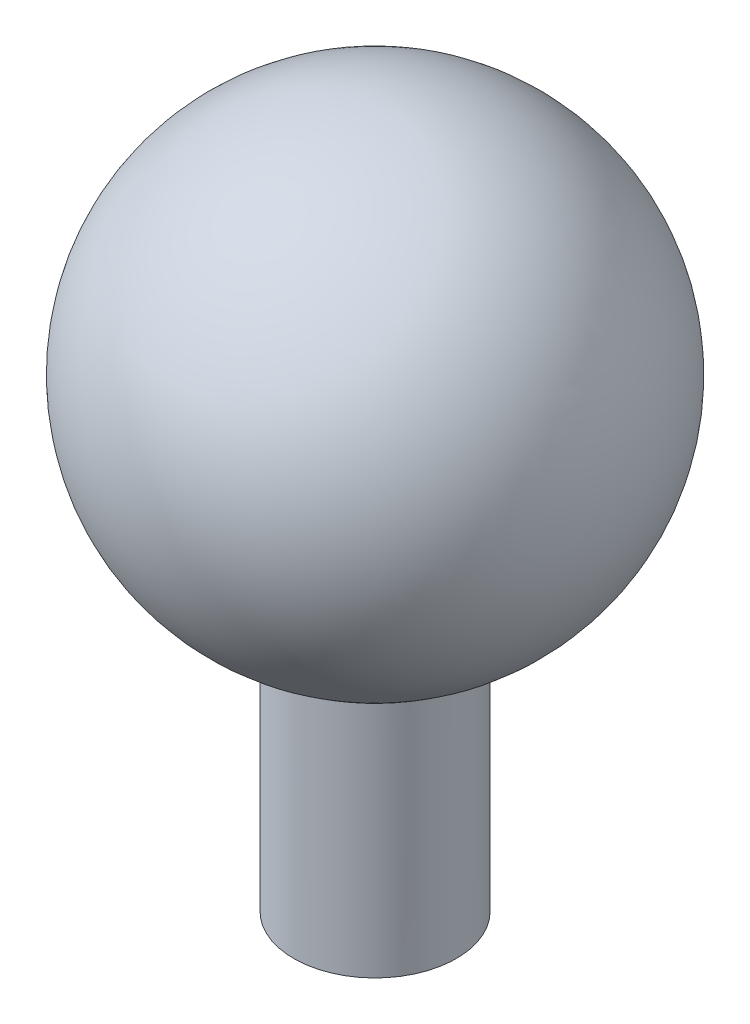
ISO-10303-21;
HEADER;
FILE_DESCRIPTION(('STEP AP214'),'2;1');
FILE_NAME('part.step','',(''),(''),'','','');
FILE_SCHEMA(('AUTOMOTIVE_DESIGN { 1 0 10303 214 1 1 1 1 }'));
ENDSEC;
DATA;
#1=APPLICATION_CONTEXT('core data for automotive mechanical design processes');
#2=APPLICATION_PROTOCOL_DEFINITION('international standard','automotive_design',2000,#1);
#3=PRODUCT_CONTEXT('',#1,'mechanical');
#4=PRODUCT('Part','Part','',(#3));
#5=PRODUCT_RELATED_PRODUCT_CATEGORY('part','',(#4));
#6=PRODUCT_DEFINITION_FORMATION('','',#4);
#7=PRODUCT_DEFINITION_CONTEXT('part definition',#1,'design');
#8=PRODUCT_DEFINITION('design','',#6,#7);
#9=PRODUCT_DEFINITION_SHAPE('','',#8);
#10=(LENGTH_UNIT() NAMED_UNIT(*) SI_UNIT(.MILLI.,.METRE.));
#11=(NAMED_UNIT(*) PLANE_ANGLE_UNIT() SI_UNIT($,.RADIAN.));
#12=(NAMED_UNIT(*) SI_UNIT($,.STERADIAN.) SOLID_ANGLE_UNIT());
#13=UNCERTAINTY_MEASURE_WITH_UNIT(LENGTH_MEASURE(1.E-05),#10,'distance_accuracy_value','');
#14=(GEOMETRIC_REPRESENTATION_CONTEXT(3) GLOBAL_UNCERTAINTY_ASSIGNED_CONTEXT((#13)) GLOBAL_UNIT_ASSIGNED_CONTEXT((#10,
#11,#12)) REPRESENTATION_CONTEXT('',''));
#15=CARTESIAN_POINT('',(0.,0.,0.));
#16=DIRECTION('',(0.,0.,1.));
#17=DIRECTION('',(1.,0.,0.));
#18=AXIS2_PLACEMENT_3D('',#15,#16,#17);
#19=CARTESIAN_POINT('',(0.,0.,0.));
#20=DIRECTION('',(0.,1.,0.));
#21=DIRECTION('',(1.,0.,0.));
#22=AXIS2_PLACEMENT_3D('',#19,#20,#21);
#23=SPHERICAL_SURFACE('',#22,5.);
#24=CARTESIAN_POINT('',(0.,-4.6837484987988,0.));
#25=DIRECTION('',(0.,1.,0.));
#26=DIRECTION('',(-1.,0.,0.));
#27=AXIS2_PLACEMENT_3D('',#24,#25,#26);
#28=CIRCLE('',#27,1.75);
#29=CARTESIAN_POINT('',(-1.75,-4.6837484987988,0.));
#30=VERTEX_POINT('',#29);
#31=EDGE_CURVE('E10',#30,#30,#28,.T.);
#32=ORIENTED_EDGE('',*,*,#31,.T.);
#33=EDGE_LOOP('',(#32));
#34=FACE_BOUND('',#33,.T.);
#35=ADVANCED_FACE('F34',(#34),#23,.T.);
#36=CARTESIAN_POINT('',(0.,5.,0.));
#37=DIRECTION('',(0.,1.,0.));
#38=DIRECTION('',(-1.,0.,0.));
#39=AXIS2_PLACEMENT_3D('',#36,#37,#38);
#40=CYLINDRICAL_SURFACE('',#39,1.75);
#41=CARTESIAN_POINT('',(0.,-10.,0.));
#42=DIRECTION('',(0.,1.,0.));
#43=DIRECTION('',(-1.,0.,0.));
#44=AXIS2_PLACEMENT_3D('',#41,#42,#43);
#45=CIRCLE('',#44,1.75);
#46=CARTESIAN_POINT('',(-1.75,-10.,0.));
#47=VERTEX_POINT('',#46);
#48=EDGE_CURVE('E41',#47,#47,#45,.T.);
#49=ORIENTED_EDGE('',*,*,#48,.T.);
#50=EDGE_LOOP('',(#49));
#51=FACE_BOUND('',#50,.T.);
#52=ORIENTED_EDGE('',*,*,#31,.F.);
#53=EDGE_LOOP('',(#52));
#54=FACE_BOUND('',#53,.T.);
#55=ADVANCED_FACE('F50',(#51,#54),#40,.T.);
#56=CARTESIAN_POINT('',(0.,-10.,0.));
#57=DIRECTION('',(0.,-1.,0.));
#58=DIRECTION('',(1.,0.,0.));
#59=AXIS2_PLACEMENT_3D('',#56,#57,#58);
#60=PLANE('',#59);
#61=ORIENTED_EDGE('',*,*,#48,.F.);
#62=EDGE_LOOP('',(#61));
#63=FACE_BOUND('',#62,.T.);
#64=ADVANCED_FACE('F53',(#63),#60,.T.);
#65=CLOSED_SHELL('',(#35,#55,#64));
#66=MANIFOLD_SOLID_BREP('B2',#65);
#67=ADVANCED_BREP_SHAPE_REPRESENTATION('',(#18,#66),#14);
#68=SHAPE_DEFINITION_REPRESENTATION(#9,#67);
ENDSEC;
END-ISO-10303-21;
